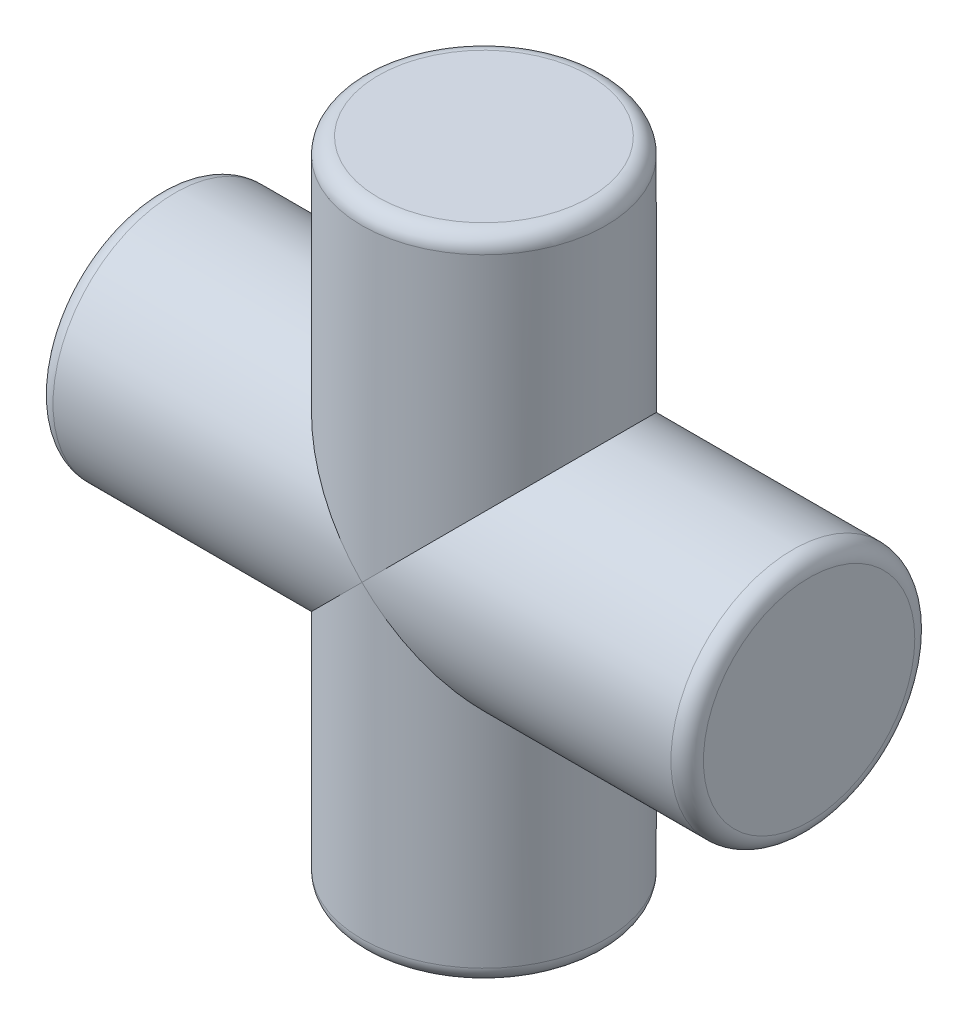
ISO-10303-21;
HEADER;
FILE_DESCRIPTION(('STEP AP214'),'2;1');
FILE_NAME('part.step','',(''),(''),'','','');
FILE_SCHEMA(('AUTOMOTIVE_DESIGN { 1 0 10303 214 1 1 1 1 }'));
ENDSEC;
DATA;
#1=APPLICATION_CONTEXT('core data for automotive mechanical design processes');
#2=APPLICATION_PROTOCOL_DEFINITION('international standard','automotive_design',2000,#1);
#3=PRODUCT_CONTEXT('',#1,'mechanical');
#4=PRODUCT('Part','Part','',(#3));
#5=PRODUCT_RELATED_PRODUCT_CATEGORY('part','',(#4));
#6=PRODUCT_DEFINITION_FORMATION('','',#4);
#7=PRODUCT_DEFINITION_CONTEXT('part definition',#1,'design');
#8=PRODUCT_DEFINITION('design','',#6,#7);
#9=PRODUCT_DEFINITION_SHAPE('','',#8);
#10=(LENGTH_UNIT() NAMED_UNIT(*) SI_UNIT(.MILLI.,.METRE.));
#11=(NAMED_UNIT(*) PLANE_ANGLE_UNIT() SI_UNIT($,.RADIAN.));
#12=(NAMED_UNIT(*) SI_UNIT($,.STERADIAN.) SOLID_ANGLE_UNIT());
#13=UNCERTAINTY_MEASURE_WITH_UNIT(LENGTH_MEASURE(1.E-05),#10,'distance_accuracy_value','');
#14=(GEOMETRIC_REPRESENTATION_CONTEXT(3) GLOBAL_UNCERTAINTY_ASSIGNED_CONTEXT((#13)) GLOBAL_UNIT_ASSIGNED_CONTEXT((#10,
#11,#12)) REPRESENTATION_CONTEXT('',''));
#15=CARTESIAN_POINT('',(0.,0.,0.));
#16=DIRECTION('',(0.,0.,1.));
#17=DIRECTION('',(1.,0.,0.));
#18=AXIS2_PLACEMENT_3D('',#15,#16,#17);
#19=CARTESIAN_POINT('',(0.,20.,0.));
#20=DIRECTION('',(0.,-1.,0.));
#21=DIRECTION('',(0.,0.,-1.));
#22=AXIS2_PLACEMENT_3D('',#19,#20,#21);
#23=CYLINDRICAL_SURFACE('',#22,7.5);
#24=CARTESIAN_POINT('',(0.,19.,0.));
#25=DIRECTION('',(0.,1.,0.));
#26=DIRECTION('',(0.,0.,1.));
#27=AXIS2_PLACEMENT_3D('',#24,#25,#26);
#28=CIRCLE('',#27,7.5);
#29=CARTESIAN_POINT('',(0.,19.,7.5));
#30=VERTEX_POINT('',#29);
#31=EDGE_CURVE('E11',#30,#30,#28,.F.);
#32=ORIENTED_EDGE('',*,*,#31,.T.);
#33=EDGE_LOOP('',(#32));
#34=FACE_BOUND('',#33,.T.);
#35=CARTESIAN_POINT('',(0.,0.,0.));
#36=DIRECTION('',(-0.707106781186547,-0.707106781186547,0.));
#37=DIRECTION('',(0.707106781186547,-0.707106781186547,0.));
#38=AXIS2_PLACEMENT_3D('',#35,#36,#37);
#39=ELLIPSE('',#38,10.6066017177982,7.5);
#40=CARTESIAN_POINT('',(0.,0.,7.5));
#41=VERTEX_POINT('',#40);
#42=CARTESIAN_POINT('',(0.,0.,-7.5));
#43=VERTEX_POINT('',#42);
#44=EDGE_CURVE('E58',#41,#43,#39,.T.);
#45=ORIENTED_EDGE('',*,*,#44,.F.);
#46=CARTESIAN_POINT('',(0.,0.,0.));
#47=DIRECTION('',(0.707106781186547,-0.707106781186547,0.));
#48=DIRECTION('',(-0.707106781186547,-0.707106781186547,0.));
#49=AXIS2_PLACEMENT_3D('',#46,#47,#48);
#50=ELLIPSE('',#49,10.6066017177982,7.5);
#51=EDGE_CURVE('E57',#43,#41,#50,.T.);
#52=ORIENTED_EDGE('',*,*,#51,.F.);
#53=EDGE_LOOP('',(#45,#52));
#54=FACE_BOUND('',#53,.T.);
#55=ADVANCED_FACE('F37',(#34,#54),#23,.T.);
#56=CARTESIAN_POINT('',(0.,20.,0.));
#57=DIRECTION('',(0.,1.,0.));
#58=DIRECTION('',(0.,0.,1.));
#59=AXIS2_PLACEMENT_3D('',#56,#57,#58);
#60=PLANE('',#59);
#61=CARTESIAN_POINT('',(0.,20.,0.));
#62=DIRECTION('',(0.,1.,0.));
#63=DIRECTION('',(0.,0.,1.));
#64=AXIS2_PLACEMENT_3D('',#61,#62,#63);
#65=CIRCLE('',#64,6.5);
#66=CARTESIAN_POINT('',(0.,20.,6.5));
#67=VERTEX_POINT('',#66);
#68=EDGE_CURVE('E45',#67,#67,#65,.T.);
#69=ORIENTED_EDGE('',*,*,#68,.T.);
#70=EDGE_LOOP('',(#69));
#71=FACE_BOUND('',#70,.T.);
#72=ADVANCED_FACE('F91',(#71),#60,.T.);
#73=CARTESIAN_POINT('',(-20.,0.,0.));
#74=DIRECTION('',(1.,0.,0.));
#75=DIRECTION('',(0.,0.,-1.));
#76=AXIS2_PLACEMENT_3D('',#73,#74,#75);
#77=PLANE('',#76);
#78=CARTESIAN_POINT('',(-20.,0.,0.));
#79=DIRECTION('',(1.,0.,0.));
#80=DIRECTION('',(0.,0.,-1.));
#81=AXIS2_PLACEMENT_3D('',#78,#79,#80);
#82=CIRCLE('',#81,6.5);
#83=CARTESIAN_POINT('',(-20.,0.,-6.5));
#84=VERTEX_POINT('',#83);
#85=EDGE_CURVE('E72',#84,#84,#82,.F.);
#86=ORIENTED_EDGE('',*,*,#85,.T.);
#87=EDGE_LOOP('',(#86));
#88=FACE_BOUND('',#87,.T.);
#89=ADVANCED_FACE('F108',(#88),#77,.F.);
#90=CARTESIAN_POINT('',(20.,0.,0.));
#91=DIRECTION('',(-1.,0.,0.));
#92=DIRECTION('',(0.,0.,1.));
#93=AXIS2_PLACEMENT_3D('',#90,#91,#92);
#94=CYLINDRICAL_SURFACE('',#93,7.5);
#95=CARTESIAN_POINT('',(-19.,0.,0.));
#96=DIRECTION('',(1.,0.,0.));
#97=DIRECTION('',(0.,0.,-1.));
#98=AXIS2_PLACEMENT_3D('',#95,#96,#97);
#99=CIRCLE('',#98,7.5);
#100=CARTESIAN_POINT('',(-19.,0.,-7.5));
#101=VERTEX_POINT('',#100);
#102=EDGE_CURVE('E69',#101,#101,#99,.T.);
#103=ORIENTED_EDGE('',*,*,#102,.T.);
#104=EDGE_LOOP('',(#103));
#105=FACE_BOUND('',#104,.T.);
#106=CARTESIAN_POINT('',(0.,0.,0.));
#107=DIRECTION('',(0.707106781186547,-0.707106781186547,0.));
#108=DIRECTION('',(-0.707106781186547,-0.707106781186547,0.));
#109=AXIS2_PLACEMENT_3D('',#106,#107,#108);
#110=ELLIPSE('',#109,10.6066017177982,7.5);
#111=EDGE_CURVE('E51',#43,#41,#110,.F.);
#112=ORIENTED_EDGE('',*,*,#111,.T.);
#113=ORIENTED_EDGE('',*,*,#44,.T.);
#114=EDGE_LOOP('',(#112,#113));
#115=FACE_BOUND('',#114,.T.);
#116=ADVANCED_FACE('F66',(#105,#115),#94,.T.);
#117=CARTESIAN_POINT('',(0.,-20.,0.));
#118=DIRECTION('',(0.,1.,0.));
#119=DIRECTION('',(0.,0.,1.));
#120=AXIS2_PLACEMENT_3D('',#117,#118,#119);
#121=PLANE('',#120);
#122=CARTESIAN_POINT('',(0.,-20.,0.));
#123=DIRECTION('',(0.,1.,0.));
#124=DIRECTION('',(0.,0.,1.));
#125=AXIS2_PLACEMENT_3D('',#122,#123,#124);
#126=CIRCLE('',#125,6.5);
#127=CARTESIAN_POINT('',(0.,-20.,6.5));
#128=VERTEX_POINT('',#127);
#129=EDGE_CURVE('E80',#128,#128,#126,.F.);
#130=ORIENTED_EDGE('',*,*,#129,.T.);
#131=EDGE_LOOP('',(#130));
#132=FACE_BOUND('',#131,.T.);
#133=ADVANCED_FACE('F113',(#132),#121,.F.);
#134=CARTESIAN_POINT('',(0.,-19.,0.));
#135=DIRECTION('',(0.,1.,0.));
#136=DIRECTION('',(0.,0.,1.));
#137=AXIS2_PLACEMENT_3D('',#134,#135,#136);
#138=CIRCLE('',#137,7.5);
#139=CARTESIAN_POINT('',(0.,-19.,7.5));
#140=VERTEX_POINT('',#139);
#141=EDGE_CURVE('E77',#140,#140,#138,.T.);
#142=ORIENTED_EDGE('',*,*,#141,.T.);
#143=EDGE_LOOP('',(#142));
#144=FACE_BOUND('',#143,.T.);
#145=CARTESIAN_POINT('',(0.,0.,0.));
#146=DIRECTION('',(-0.707106781186547,-0.707106781186547,0.));
#147=DIRECTION('',(0.707106781186547,-0.707106781186547,0.));
#148=AXIS2_PLACEMENT_3D('',#145,#146,#147);
#149=ELLIPSE('',#148,10.6066017177982,7.5);
#150=EDGE_CURVE('E64',#41,#43,#149,.F.);
#151=ORIENTED_EDGE('',*,*,#150,.F.);
#152=ORIENTED_EDGE('',*,*,#111,.F.);
#153=EDGE_LOOP('',(#151,#152));
#154=FACE_BOUND('',#153,.T.);
#155=ADVANCED_FACE('F63',(#144,#154),#23,.T.);
#156=CARTESIAN_POINT('',(19.,0.,0.));
#157=DIRECTION('',(1.,0.,0.));
#158=DIRECTION('',(0.,0.,-1.));
#159=AXIS2_PLACEMENT_3D('',#156,#157,#158);
#160=CIRCLE('',#159,7.5);
#161=CARTESIAN_POINT('',(19.,0.,-7.5));
#162=VERTEX_POINT('',#161);
#163=EDGE_CURVE('E86',#162,#162,#160,.F.);
#164=ORIENTED_EDGE('',*,*,#163,.T.);
#165=EDGE_LOOP('',(#164));
#166=FACE_BOUND('',#165,.T.);
#167=ORIENTED_EDGE('',*,*,#51,.T.);
#168=ORIENTED_EDGE('',*,*,#150,.T.);
#169=EDGE_LOOP('',(#167,#168));
#170=FACE_BOUND('',#169,.T.);
#171=ADVANCED_FACE('F68',(#166,#170),#94,.T.);
#172=CARTESIAN_POINT('',(20.,0.,0.));
#173=DIRECTION('',(1.,0.,0.));
#174=DIRECTION('',(0.,0.,-1.));
#175=AXIS2_PLACEMENT_3D('',#172,#173,#174);
#176=PLANE('',#175);
#177=CARTESIAN_POINT('',(20.,0.,0.));
#178=DIRECTION('',(1.,0.,0.));
#179=DIRECTION('',(0.,0.,-1.));
#180=AXIS2_PLACEMENT_3D('',#177,#178,#179);
#181=CIRCLE('',#180,6.5);
#182=CARTESIAN_POINT('',(20.,0.,-6.5));
#183=VERTEX_POINT('',#182);
#184=EDGE_CURVE('E83',#183,#183,#181,.T.);
#185=ORIENTED_EDGE('',*,*,#184,.T.);
#186=EDGE_LOOP('',(#185));
#187=FACE_BOUND('',#186,.T.);
#188=ADVANCED_FACE('F119',(#187),#176,.T.);
#189=CARTESIAN_POINT('',(-19.,0.,0.));
#190=DIRECTION('',(1.,0.,0.));
#191=DIRECTION('',(0.,0.,-1.));
#192=AXIS2_PLACEMENT_3D('',#189,#190,#191);
#193=TOROIDAL_SURFACE('',#192,6.5,1.);
#194=ORIENTED_EDGE('',*,*,#85,.F.);
#195=EDGE_LOOP('',(#194));
#196=FACE_BOUND('',#195,.T.);
#197=ORIENTED_EDGE('',*,*,#102,.F.);
#198=EDGE_LOOP('',(#197));
#199=FACE_BOUND('',#198,.T.);
#200=ADVANCED_FACE('F126',(#196,#199),#193,.T.);
#201=CARTESIAN_POINT('',(0.,-19.,0.));
#202=DIRECTION('',(0.,1.,0.));
#203=DIRECTION('',(0.,0.,1.));
#204=AXIS2_PLACEMENT_3D('',#201,#202,#203);
#205=TOROIDAL_SURFACE('',#204,6.5,1.);
#206=ORIENTED_EDGE('',*,*,#129,.F.);
#207=EDGE_LOOP('',(#206));
#208=FACE_BOUND('',#207,.T.);
#209=ORIENTED_EDGE('',*,*,#141,.F.);
#210=EDGE_LOOP('',(#209));
#211=FACE_BOUND('',#210,.T.);
#212=ADVANCED_FACE('F99',(#208,#211),#205,.T.);
#213=CARTESIAN_POINT('',(19.,0.,0.));
#214=DIRECTION('',(1.,0.,0.));
#215=DIRECTION('',(0.,0.,-1.));
#216=AXIS2_PLACEMENT_3D('',#213,#214,#215);
#217=TOROIDAL_SURFACE('',#216,6.5,1.);
#218=ORIENTED_EDGE('',*,*,#163,.F.);
#219=EDGE_LOOP('',(#218));
#220=FACE_BOUND('',#219,.T.);
#221=ORIENTED_EDGE('',*,*,#184,.F.);
#222=EDGE_LOOP('',(#221));
#223=FACE_BOUND('',#222,.T.);
#224=ADVANCED_FACE('F94',(#220,#223),#217,.T.);
#225=CARTESIAN_POINT('',(0.,19.,0.));
#226=DIRECTION('',(0.,1.,0.));
#227=DIRECTION('',(0.,0.,1.));
#228=AXIS2_PLACEMENT_3D('',#225,#226,#227);
#229=TOROIDAL_SURFACE('',#228,6.5,1.);
#230=ORIENTED_EDGE('',*,*,#31,.F.);
#231=EDGE_LOOP('',(#230));
#232=FACE_BOUND('',#231,.T.);
#233=ORIENTED_EDGE('',*,*,#68,.F.);
#234=EDGE_LOOP('',(#233));
#235=FACE_BOUND('',#234,.T.);
#236=ADVANCED_FACE('F39',(#232,#235),#229,.T.);
#237=CLOSED_SHELL('',(#55,#72,#89,#116,#133,#155,#171,#188,#200,#212,#224,#236));
#238=MANIFOLD_SOLID_BREP('B2',#237);
#239=ADVANCED_BREP_SHAPE_REPRESENTATION('',(#18,#238),#14);
#240=SHAPE_DEFINITION_REPRESENTATION(#9,#239);
ENDSEC;
END-ISO-10303-21;
